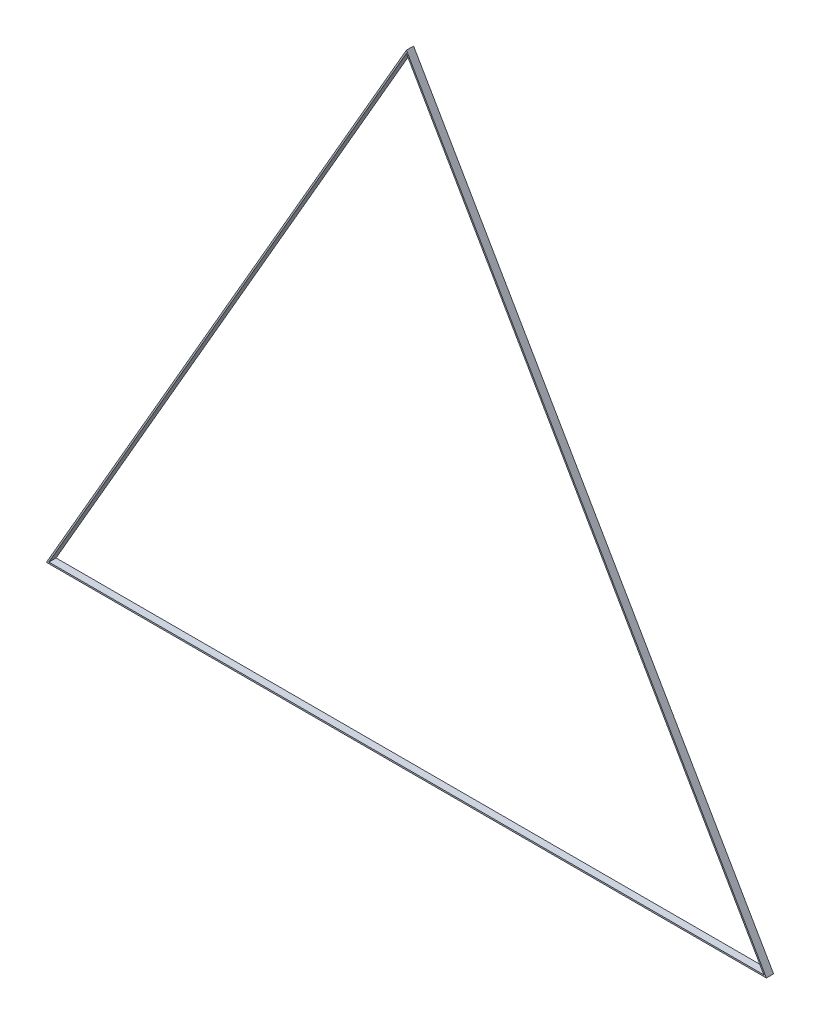
ISO-10303-21;
HEADER;
FILE_DESCRIPTION(('STEP AP214'),'2;1');
FILE_NAME('part.step','',(''),(''),'','','');
FILE_SCHEMA(('AUTOMOTIVE_DESIGN { 1 0 10303 214 1 1 1 1 }'));
ENDSEC;
DATA;
#1=APPLICATION_CONTEXT('core data for automotive mechanical design processes');
#2=APPLICATION_PROTOCOL_DEFINITION('international standard','automotive_design',2000,#1);
#3=PRODUCT_CONTEXT('',#1,'mechanical');
#4=PRODUCT('Part','Part','',(#3));
#5=PRODUCT_RELATED_PRODUCT_CATEGORY('part','',(#4));
#6=PRODUCT_DEFINITION_FORMATION('','',#4);
#7=PRODUCT_DEFINITION_CONTEXT('part definition',#1,'design');
#8=PRODUCT_DEFINITION('design','',#6,#7);
#9=PRODUCT_DEFINITION_SHAPE('','',#8);
#10=(LENGTH_UNIT() NAMED_UNIT(*) SI_UNIT(.MILLI.,.METRE.));
#11=(NAMED_UNIT(*) PLANE_ANGLE_UNIT() SI_UNIT($,.RADIAN.));
#12=(NAMED_UNIT(*) SI_UNIT($,.STERADIAN.) SOLID_ANGLE_UNIT());
#13=UNCERTAINTY_MEASURE_WITH_UNIT(LENGTH_MEASURE(1.E-05),#10,'distance_accuracy_value','');
#14=(GEOMETRIC_REPRESENTATION_CONTEXT(3) GLOBAL_UNCERTAINTY_ASSIGNED_CONTEXT((#13)) GLOBAL_UNIT_ASSIGNED_CONTEXT((#10,
#11,#12)) REPRESENTATION_CONTEXT('',''));
#15=CARTESIAN_POINT('',(0.,0.,0.));
#16=DIRECTION('',(0.,0.,1.));
#17=DIRECTION('',(1.,0.,0.));
#18=AXIS2_PLACEMENT_3D('',#15,#16,#17);
#19=CARTESIAN_POINT('',(500.,1.22464679914735E-13,10.));
#20=DIRECTION('',(0.,1.,0.));
#21=DIRECTION('',(-1.,0.,0.));
#22=AXIS2_PLACEMENT_3D('',#19,#20,#21);
#23=PLANE('',#22);
#24=DIRECTION('',(1.,0.,0.));
#25=VECTOR('',#24,1.);
#26=CARTESIAN_POINT('',(500.,1.22464679914735E-13,0.));
#27=LINE('',#26,#25);
#28=CARTESIAN_POINT('',(-500.,-1.83697019872103E-13,0.));
#29=VERTEX_POINT('',#28);
#30=CARTESIAN_POINT('',(500.,1.22464679914735E-13,0.));
#31=VERTEX_POINT('',#30);
#32=EDGE_CURVE('E111',#29,#31,#27,.T.);
#33=ORIENTED_EDGE('',*,*,#32,.T.);
#34=DIRECTION('',(0.,0.,-1.));
#35=VECTOR('',#34,1.);
#36=CARTESIAN_POINT('',(500.,1.22464679914735E-13,10.));
#37=LINE('',#36,#35);
#38=CARTESIAN_POINT('',(500.,1.22464679914735E-13,10.));
#39=VERTEX_POINT('',#38);
#40=EDGE_CURVE('E11',#39,#31,#37,.T.);
#41=ORIENTED_EDGE('',*,*,#40,.F.);
#42=DIRECTION('',(1.,0.,0.));
#43=VECTOR('',#42,1.);
#44=CARTESIAN_POINT('',(500.,1.22464679914735E-13,10.));
#45=LINE('',#44,#43);
#46=CARTESIAN_POINT('',(-500.,-1.83697019872103E-13,10.));
#47=VERTEX_POINT('',#46);
#48=EDGE_CURVE('E113',#47,#39,#45,.T.);
#49=ORIENTED_EDGE('',*,*,#48,.F.);
#50=DIRECTION('',(0.,0.,-1.));
#51=VECTOR('',#50,1.);
#52=CARTESIAN_POINT('',(-500.,-1.83697019872103E-13,10.));
#53=LINE('',#52,#51);
#54=EDGE_CURVE('E121',#47,#29,#53,.T.);
#55=ORIENTED_EDGE('',*,*,#54,.T.);
#56=EDGE_LOOP('',(#33,#41,#49,#55));
#57=FACE_BOUND('',#56,.T.);
#58=ADVANCED_FACE('F33',(#57),#23,.F.);
#59=CARTESIAN_POINT('',(-3.33066907387547E-13,866.025403784438,10.));
#60=DIRECTION('',(-0.866025403784438,-0.500000000000001,0.));
#61=DIRECTION('',(0.500000000000001,-0.866025403784438,0.));
#62=AXIS2_PLACEMENT_3D('',#59,#60,#61);
#63=PLANE('',#62);
#64=DIRECTION('',(-0.500000000000001,0.866025403784438,0.));
#65=VECTOR('',#64,1.);
#66=CARTESIAN_POINT('',(-3.33066907387547E-13,866.025403784438,0.));
#67=LINE('',#66,#65);
#68=CARTESIAN_POINT('',(-3.33066907387547E-13,866.025403784438,0.));
#69=VERTEX_POINT('',#68);
#70=EDGE_CURVE('E124',#31,#69,#67,.T.);
#71=ORIENTED_EDGE('',*,*,#70,.T.);
#72=DIRECTION('',(0.,0.,-1.));
#73=VECTOR('',#72,1.);
#74=CARTESIAN_POINT('',(-3.33066907387547E-13,866.025403784438,10.));
#75=LINE('',#74,#73);
#76=CARTESIAN_POINT('',(-3.33066907387547E-13,866.025403784438,10.));
#77=VERTEX_POINT('',#76);
#78=EDGE_CURVE('E40',#77,#69,#75,.T.);
#79=ORIENTED_EDGE('',*,*,#78,.F.);
#80=DIRECTION('',(-0.500000000000001,0.866025403784438,0.));
#81=VECTOR('',#80,1.);
#82=CARTESIAN_POINT('',(-3.33066907387547E-13,866.025403784438,10.));
#83=LINE('',#82,#81);
#84=EDGE_CURVE('E116',#39,#77,#83,.T.);
#85=ORIENTED_EDGE('',*,*,#84,.F.);
#86=ORIENTED_EDGE('',*,*,#40,.T.);
#87=EDGE_LOOP('',(#71,#79,#85,#86));
#88=FACE_BOUND('',#87,.T.);
#89=ADVANCED_FACE('F142',(#88),#63,.F.);
#90=CARTESIAN_POINT('',(-500.,-1.83697019872103E-13,10.));
#91=DIRECTION('',(0.866025403784439,-0.5,0.));
#92=DIRECTION('',(0.5,0.866025403784439,0.));
#93=AXIS2_PLACEMENT_3D('',#90,#91,#92);
#94=PLANE('',#93);
#95=DIRECTION('',(-0.5,-0.866025403784439,0.));
#96=VECTOR('',#95,1.);
#97=CARTESIAN_POINT('',(-500.,-1.83697019872103E-13,0.));
#98=LINE('',#97,#96);
#99=EDGE_CURVE('E117',#69,#29,#98,.T.);
#100=ORIENTED_EDGE('',*,*,#99,.T.);
#101=ORIENTED_EDGE('',*,*,#54,.F.);
#102=DIRECTION('',(-0.5,-0.866025403784439,0.));
#103=VECTOR('',#102,1.);
#104=CARTESIAN_POINT('',(-500.,-1.83697019872103E-13,10.));
#105=LINE('',#104,#103);
#106=EDGE_CURVE('E119',#77,#47,#105,.T.);
#107=ORIENTED_EDGE('',*,*,#106,.F.);
#108=ORIENTED_EDGE('',*,*,#78,.T.);
#109=EDGE_LOOP('',(#100,#101,#107,#108));
#110=FACE_BOUND('',#109,.T.);
#111=ADVANCED_FACE('F133',(#110),#94,.F.);
#112=CARTESIAN_POINT('',(0.,0.,10.));
#113=DIRECTION('',(0.,0.,-1.));
#114=DIRECTION('',(-1.,0.,0.));
#115=AXIS2_PLACEMENT_3D('',#112,#113,#114);
#116=PLANE('',#115);
#117=DIRECTION('',(-0.5,0.866025403784439,0.));
#118=VECTOR('',#117,1.);
#119=CARTESIAN_POINT('',(0.,862.025403784439,10.));
#120=LINE('',#119,#118);
#121=CARTESIAN_POINT('',(496.535898384863,1.99999999999972,10.));
#122=VERTEX_POINT('',#121);
#123=CARTESIAN_POINT('',(0.,862.025403784439,10.));
#124=VERTEX_POINT('',#123);
#125=EDGE_CURVE('E103',#122,#124,#120,.T.);
#126=ORIENTED_EDGE('',*,*,#125,.F.);
#127=DIRECTION('',(1.,0.,0.));
#128=VECTOR('',#127,1.);
#129=CARTESIAN_POINT('',(496.535898384863,1.99999999999969,10.));
#130=LINE('',#129,#128);
#131=CARTESIAN_POINT('',(-496.535898384863,1.99999999999954,10.));
#132=VERTEX_POINT('',#131);
#133=EDGE_CURVE('E47',#132,#122,#130,.T.);
#134=ORIENTED_EDGE('',*,*,#133,.F.);
#135=DIRECTION('',(-0.5,-0.866025403784439,0.));
#136=VECTOR('',#135,1.);
#137=CARTESIAN_POINT('',(-496.535898384863,1.99999999999954,10.));
#138=LINE('',#137,#136);
#139=EDGE_CURVE('E100',#124,#132,#138,.T.);
#140=ORIENTED_EDGE('',*,*,#139,.F.);
#141=EDGE_LOOP('',(#126,#134,#140));
#142=FACE_BOUND('',#141,.T.);
#143=ORIENTED_EDGE('',*,*,#48,.T.);
#144=ORIENTED_EDGE('',*,*,#84,.T.);
#145=ORIENTED_EDGE('',*,*,#106,.T.);
#146=EDGE_LOOP('',(#143,#144,#145));
#147=FACE_BOUND('',#146,.T.);
#148=ADVANCED_FACE('F141',(#142,#147),#116,.F.);
#149=CARTESIAN_POINT('',(0.,0.,0.));
#150=DIRECTION('',(0.,0.,-1.));
#151=DIRECTION('',(-1.,0.,0.));
#152=AXIS2_PLACEMENT_3D('',#149,#150,#151);
#153=PLANE('',#152);
#154=DIRECTION('',(1.,0.,0.));
#155=VECTOR('',#154,1.);
#156=CARTESIAN_POINT('',(496.535898384863,1.99999999999969,0.));
#157=LINE('',#156,#155);
#158=CARTESIAN_POINT('',(-496.535898384863,1.99999999999954,0.));
#159=VERTEX_POINT('',#158);
#160=CARTESIAN_POINT('',(496.535898384863,1.99999999999969,0.));
#161=VERTEX_POINT('',#160);
#162=EDGE_CURVE('E87',#159,#161,#157,.T.);
#163=ORIENTED_EDGE('',*,*,#162,.T.);
#164=DIRECTION('',(-0.5,0.866025403784439,0.));
#165=VECTOR('',#164,1.);
#166=CARTESIAN_POINT('',(0.,862.025403784439,0.));
#167=LINE('',#166,#165);
#168=CARTESIAN_POINT('',(0.,862.025403784439,0.));
#169=VERTEX_POINT('',#168);
#170=EDGE_CURVE('E94',#161,#169,#167,.T.);
#171=ORIENTED_EDGE('',*,*,#170,.T.);
#172=DIRECTION('',(-0.5,-0.866025403784439,0.));
#173=VECTOR('',#172,1.);
#174=CARTESIAN_POINT('',(-496.535898384863,1.99999999999954,0.));
#175=LINE('',#174,#173);
#176=EDGE_CURVE('E55',#169,#159,#175,.T.);
#177=ORIENTED_EDGE('',*,*,#176,.T.);
#178=EDGE_LOOP('',(#163,#171,#177));
#179=FACE_BOUND('',#178,.T.);
#180=ORIENTED_EDGE('',*,*,#32,.F.);
#181=ORIENTED_EDGE('',*,*,#99,.F.);
#182=ORIENTED_EDGE('',*,*,#70,.F.);
#183=EDGE_LOOP('',(#180,#181,#182));
#184=FACE_BOUND('',#183,.T.);
#185=ADVANCED_FACE('F98',(#179,#184),#153,.T.);
#186=CARTESIAN_POINT('',(496.535898384863,1.99999999999969,0.));
#187=DIRECTION('',(0.,-1.,0.));
#188=DIRECTION('',(1.,0.,0.));
#189=AXIS2_PLACEMENT_3D('',#186,#187,#188);
#190=PLANE('',#189);
#191=ORIENTED_EDGE('',*,*,#133,.T.);
#192=DIRECTION('',(0.,0.,1.));
#193=VECTOR('',#192,1.);
#194=CARTESIAN_POINT('',(496.535898384863,1.99999999999969,0.));
#195=LINE('',#194,#193);
#196=EDGE_CURVE('E83',#161,#122,#195,.T.);
#197=ORIENTED_EDGE('',*,*,#196,.F.);
#198=ORIENTED_EDGE('',*,*,#162,.F.);
#199=DIRECTION('',(0.,0.,1.));
#200=VECTOR('',#199,1.);
#201=CARTESIAN_POINT('',(-496.535898384863,1.99999999999954,0.));
#202=LINE('',#201,#200);
#203=EDGE_CURVE('E109',#159,#132,#202,.T.);
#204=ORIENTED_EDGE('',*,*,#203,.T.);
#205=EDGE_LOOP('',(#191,#197,#198,#204));
#206=FACE_BOUND('',#205,.T.);
#207=ADVANCED_FACE('F85',(#206),#190,.F.);
#208=CARTESIAN_POINT('',(-496.535898384863,1.99999999999954,0.));
#209=DIRECTION('',(-0.866025403784439,0.5,0.));
#210=DIRECTION('',(-0.5,-0.866025403784439,0.));
#211=AXIS2_PLACEMENT_3D('',#208,#209,#210);
#212=PLANE('',#211);
#213=ORIENTED_EDGE('',*,*,#139,.T.);
#214=ORIENTED_EDGE('',*,*,#203,.F.);
#215=ORIENTED_EDGE('',*,*,#176,.F.);
#216=DIRECTION('',(0.,0.,1.));
#217=VECTOR('',#216,1.);
#218=CARTESIAN_POINT('',(0.,862.025403784439,0.));
#219=LINE('',#218,#217);
#220=EDGE_CURVE('E91',#169,#124,#219,.T.);
#221=ORIENTED_EDGE('',*,*,#220,.T.);
#222=EDGE_LOOP('',(#213,#214,#215,#221));
#223=FACE_BOUND('',#222,.T.);
#224=ADVANCED_FACE('F157',(#223),#212,.F.);
#225=CARTESIAN_POINT('',(0.,862.025403784439,0.));
#226=DIRECTION('',(0.866025403784438,0.5,0.));
#227=DIRECTION('',(-0.5,0.866025403784439,0.));
#228=AXIS2_PLACEMENT_3D('',#225,#226,#227);
#229=PLANE('',#228);
#230=ORIENTED_EDGE('',*,*,#125,.T.);
#231=ORIENTED_EDGE('',*,*,#220,.F.);
#232=ORIENTED_EDGE('',*,*,#170,.F.);
#233=ORIENTED_EDGE('',*,*,#196,.T.);
#234=EDGE_LOOP('',(#230,#231,#232,#233));
#235=FACE_BOUND('',#234,.T.);
#236=ADVANCED_FACE('F95',(#235),#229,.F.);
#237=CLOSED_SHELL('',(#58,#89,#111,#148,#185,#207,#224,#236));
#238=MANIFOLD_SOLID_BREP('B2',#237);
#239=ADVANCED_BREP_SHAPE_REPRESENTATION('',(#18,#238),#14);
#240=SHAPE_DEFINITION_REPRESENTATION(#9,#239);
ENDSEC;
END-ISO-10303-21;
